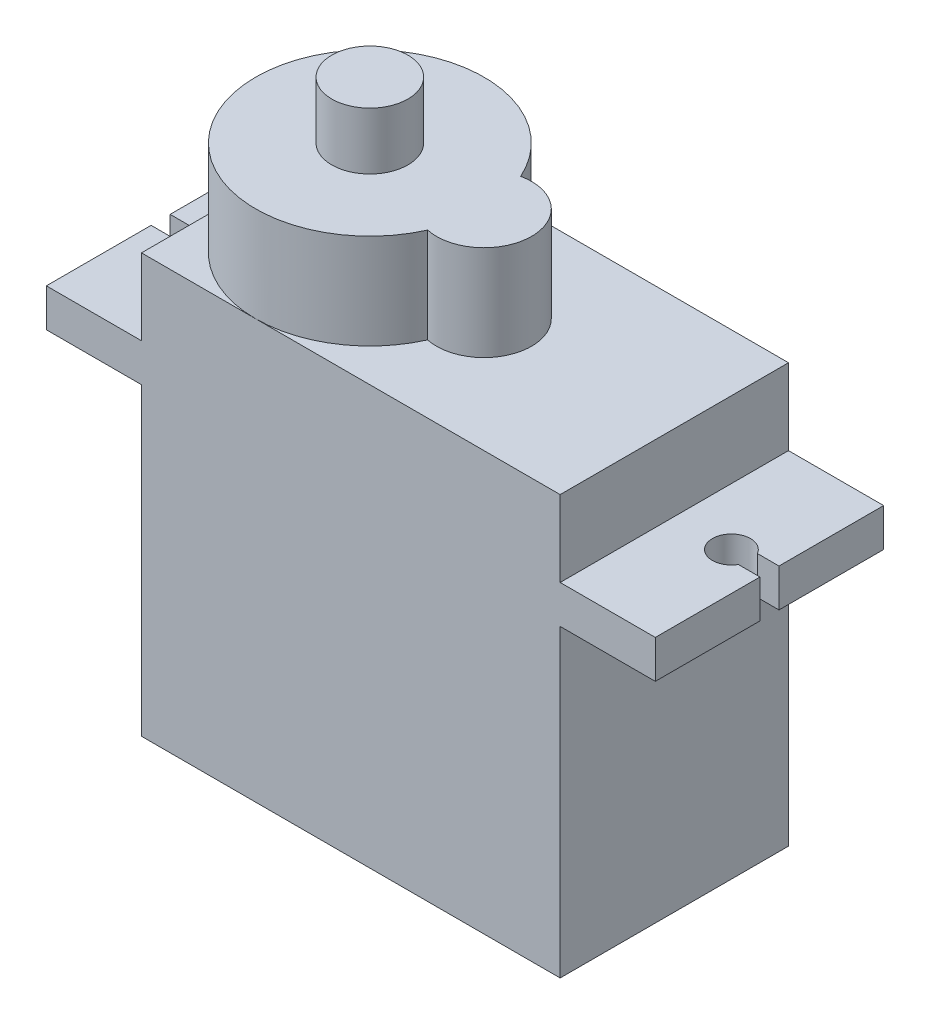
ISO-10303-21;
HEADER;
FILE_DESCRIPTION(('STEP AP214'),'2;1');
FILE_NAME('part.step','',(''),(''),'','','');
FILE_SCHEMA(('AUTOMOTIVE_DESIGN { 1 0 10303 214 1 1 1 1 }'));
ENDSEC;
DATA;
#1=APPLICATION_CONTEXT('core data for automotive mechanical design processes');
#2=APPLICATION_PROTOCOL_DEFINITION('international standard','automotive_design',2000,#1);
#3=PRODUCT_CONTEXT('',#1,'mechanical');
#4=PRODUCT('Part','Part','',(#3));
#5=PRODUCT_RELATED_PRODUCT_CATEGORY('part','',(#4));
#6=PRODUCT_DEFINITION_FORMATION('','',#4);
#7=PRODUCT_DEFINITION_CONTEXT('part definition',#1,'design');
#8=PRODUCT_DEFINITION('design','',#6,#7);
#9=PRODUCT_DEFINITION_SHAPE('','',#8);
#10=(LENGTH_UNIT() NAMED_UNIT(*) SI_UNIT(.MILLI.,.METRE.));
#11=(NAMED_UNIT(*) PLANE_ANGLE_UNIT() SI_UNIT($,.RADIAN.));
#12=(NAMED_UNIT(*) SI_UNIT($,.STERADIAN.) SOLID_ANGLE_UNIT());
#13=UNCERTAINTY_MEASURE_WITH_UNIT(LENGTH_MEASURE(1.E-05),#10,'distance_accuracy_value','');
#14=(GEOMETRIC_REPRESENTATION_CONTEXT(3) GLOBAL_UNCERTAINTY_ASSIGNED_CONTEXT((#13)) GLOBAL_UNIT_ASSIGNED_CONTEXT((#10,
#11,#12)) REPRESENTATION_CONTEXT('',''));
#15=CARTESIAN_POINT('',(0.,0.,0.));
#16=DIRECTION('',(0.,0.,1.));
#17=DIRECTION('',(1.,0.,0.));
#18=AXIS2_PLACEMENT_3D('',#15,#16,#17);
#19=CARTESIAN_POINT('',(-16.,18.,-11.3851648071345));
#20=DIRECTION('',(-1.,0.,0.));
#21=DIRECTION('',(0.,0.,1.));
#22=AXIS2_PLACEMENT_3D('',#19,#20,#21);
#23=PLANE('',#22);
#24=DIRECTION('',(0.,1.,0.));
#25=VECTOR('',#24,1.);
#26=CARTESIAN_POINT('',(-16.,15.,-0.504353806473952));
#27=LINE('',#26,#25);
#28=CARTESIAN_POINT('',(-16.,16.,-0.504353806473952));
#29=VERTEX_POINT('',#28);
#30=CARTESIAN_POINT('',(-16.,18.,-0.504353806473952));
#31=VERTEX_POINT('',#30);
#32=EDGE_CURVE('E402',#29,#31,#27,.T.);
#33=ORIENTED_EDGE('',*,*,#32,.T.);
#34=DIRECTION('',(0.,0.,1.));
#35=VECTOR('',#34,1.);
#36=CARTESIAN_POINT('',(-16.,18.,-11.3851648071345));
#37=LINE('',#36,#35);
#38=CARTESIAN_POINT('',(-16.,18.,-6.));
#39=VERTEX_POINT('',#38);
#40=EDGE_CURVE('E238',#39,#31,#37,.T.);
#41=ORIENTED_EDGE('',*,*,#40,.F.);
#42=DIRECTION('',(0.,1.,0.));
#43=VECTOR('',#42,1.);
#44=CARTESIAN_POINT('',(-16.,18.,-6.));
#45=LINE('',#44,#43);
#46=CARTESIAN_POINT('',(-16.,16.,-6.));
#47=VERTEX_POINT('',#46);
#48=EDGE_CURVE('E259',#47,#39,#45,.T.);
#49=ORIENTED_EDGE('',*,*,#48,.F.);
#50=DIRECTION('',(0.,0.,1.));
#51=VECTOR('',#50,1.);
#52=CARTESIAN_POINT('',(-16.,16.,-11.3851648071345));
#53=LINE('',#52,#51);
#54=EDGE_CURVE('E252',#47,#29,#53,.T.);
#55=ORIENTED_EDGE('',*,*,#54,.T.);
#56=EDGE_LOOP('',(#33,#41,#49,#55));
#57=FACE_BOUND('',#56,.T.);
#58=ADVANCED_FACE('F34',(#57),#23,.T.);
#59=CARTESIAN_POINT('',(16.,18.,-11.3851648071345));
#60=DIRECTION('',(1.,0.,0.));
#61=DIRECTION('',(0.,0.,-1.));
#62=AXIS2_PLACEMENT_3D('',#59,#60,#61);
#63=PLANE('',#62);
#64=DIRECTION('',(0.,1.,0.));
#65=VECTOR('',#64,1.);
#66=CARTESIAN_POINT('',(16.,15.,-0.5));
#67=LINE('',#66,#65);
#68=CARTESIAN_POINT('',(16.,16.,-0.5));
#69=VERTEX_POINT('',#68);
#70=CARTESIAN_POINT('',(16.,18.,-0.5));
#71=VERTEX_POINT('',#70);
#72=EDGE_CURVE('E414',#69,#71,#67,.T.);
#73=ORIENTED_EDGE('',*,*,#72,.F.);
#74=DIRECTION('',(0.,0.,1.));
#75=VECTOR('',#74,1.);
#76=CARTESIAN_POINT('',(16.,16.,-11.3851648071345));
#77=LINE('',#76,#75);
#78=CARTESIAN_POINT('',(16.,16.,-6.));
#79=VERTEX_POINT('',#78);
#80=EDGE_CURVE('E355',#79,#69,#77,.T.);
#81=ORIENTED_EDGE('',*,*,#80,.F.);
#82=DIRECTION('',(0.,-1.,0.));
#83=VECTOR('',#82,1.);
#84=CARTESIAN_POINT('',(16.,18.,-6.));
#85=LINE('',#84,#83);
#86=CARTESIAN_POINT('',(16.,18.,-6.));
#87=VERTEX_POINT('',#86);
#88=EDGE_CURVE('E365',#87,#79,#85,.T.);
#89=ORIENTED_EDGE('',*,*,#88,.F.);
#90=DIRECTION('',(0.,0.,1.));
#91=VECTOR('',#90,1.);
#92=CARTESIAN_POINT('',(16.,18.,-11.3851648071345));
#93=LINE('',#92,#91);
#94=EDGE_CURVE('E359',#87,#71,#93,.T.);
#95=ORIENTED_EDGE('',*,*,#94,.T.);
#96=EDGE_LOOP('',(#73,#81,#89,#95));
#97=FACE_BOUND('',#96,.T.);
#98=ADVANCED_FACE('F510',(#97),#63,.T.);
#99=CARTESIAN_POINT('',(-11.,22.,6.));
#100=DIRECTION('',(1.,0.,0.));
#101=DIRECTION('',(0.,0.,-1.));
#102=AXIS2_PLACEMENT_3D('',#99,#100,#101);
#103=PLANE('',#102);
#104=DIRECTION('',(0.,-1.,0.));
#105=VECTOR('',#104,1.);
#106=CARTESIAN_POINT('',(-11.,22.,6.));
#107=LINE('',#106,#105);
#108=CARTESIAN_POINT('',(-11.,16.,6.));
#109=VERTEX_POINT('',#108);
#110=CARTESIAN_POINT('',(-11.,0.,6.));
#111=VERTEX_POINT('',#110);
#112=EDGE_CURVE('E314',#109,#111,#107,.T.);
#113=ORIENTED_EDGE('',*,*,#112,.F.);
#114=DIRECTION('',(0.,0.,1.));
#115=VECTOR('',#114,1.);
#116=CARTESIAN_POINT('',(-11.,16.,-11.3851648071345));
#117=LINE('',#116,#115);
#118=CARTESIAN_POINT('',(-11.,16.,-6.));
#119=VERTEX_POINT('',#118);
#120=EDGE_CURVE('E244',#119,#109,#117,.T.);
#121=ORIENTED_EDGE('',*,*,#120,.F.);
#122=DIRECTION('',(0.,-1.,0.));
#123=VECTOR('',#122,1.);
#124=CARTESIAN_POINT('',(-11.,22.,-6.));
#125=LINE('',#124,#123);
#126=CARTESIAN_POINT('',(-11.,0.,-6.));
#127=VERTEX_POINT('',#126);
#128=EDGE_CURVE('E318',#119,#127,#125,.T.);
#129=ORIENTED_EDGE('',*,*,#128,.T.);
#130=DIRECTION('',(0.,0.,1.));
#131=VECTOR('',#130,1.);
#132=CARTESIAN_POINT('',(-11.,0.,6.));
#133=LINE('',#132,#131);
#134=EDGE_CURVE('E307',#127,#111,#133,.T.);
#135=ORIENTED_EDGE('',*,*,#134,.T.);
#136=EDGE_LOOP('',(#113,#121,#129,#135));
#137=FACE_BOUND('',#136,.T.);
#138=DIRECTION('',(0.,-1.,0.));
#139=VECTOR('',#138,1.);
#140=CARTESIAN_POINT('',(-11.,6.5,-1.5));
#141=LINE('',#140,#139);
#142=CARTESIAN_POINT('',(-11.,6.5,-1.5));
#143=VERTEX_POINT('',#142);
#144=CARTESIAN_POINT('',(-11.,5.,-1.5));
#145=VERTEX_POINT('',#144);
#146=EDGE_CURVE('E399',#143,#145,#141,.T.);
#147=ORIENTED_EDGE('',*,*,#146,.F.);
#148=DIRECTION('',(0.,0.,-1.));
#149=VECTOR('',#148,1.);
#150=CARTESIAN_POINT('',(-11.,6.5,-1.5));
#151=LINE('',#150,#149);
#152=CARTESIAN_POINT('',(-11.,6.5,1.5));
#153=VERTEX_POINT('',#152);
#154=EDGE_CURVE('E389',#153,#143,#151,.T.);
#155=ORIENTED_EDGE('',*,*,#154,.F.);
#156=DIRECTION('',(0.,1.,0.));
#157=VECTOR('',#156,1.);
#158=CARTESIAN_POINT('',(-11.,6.5,1.5));
#159=LINE('',#158,#157);
#160=CARTESIAN_POINT('',(-11.,5.,1.5));
#161=VERTEX_POINT('',#160);
#162=EDGE_CURVE('E393',#161,#153,#159,.T.);
#163=ORIENTED_EDGE('',*,*,#162,.F.);
#164=DIRECTION('',(0.,0.,1.));
#165=VECTOR('',#164,1.);
#166=CARTESIAN_POINT('',(-11.,5.,-1.5));
#167=LINE('',#166,#165);
#168=EDGE_CURVE('E396',#145,#161,#167,.T.);
#169=ORIENTED_EDGE('',*,*,#168,.F.);
#170=EDGE_LOOP('',(#147,#155,#163,#169));
#171=FACE_BOUND('',#170,.T.);
#172=ADVANCED_FACE('F441',(#137,#171),#103,.F.);
#173=CARTESIAN_POINT('',(11.,22.,6.));
#174=DIRECTION('',(-1.,0.,0.));
#175=DIRECTION('',(0.,0.,1.));
#176=AXIS2_PLACEMENT_3D('',#173,#174,#175);
#177=PLANE('',#176);
#178=DIRECTION('',(0.,0.,1.));
#179=VECTOR('',#178,1.);
#180=CARTESIAN_POINT('',(11.,18.,-11.3851648071345));
#181=LINE('',#180,#179);
#182=CARTESIAN_POINT('',(11.,18.,-6.));
#183=VERTEX_POINT('',#182);
#184=CARTESIAN_POINT('',(11.,18.,6.));
#185=VERTEX_POINT('',#184);
#186=EDGE_CURVE('E362',#183,#185,#181,.T.);
#187=ORIENTED_EDGE('',*,*,#186,.F.);
#188=DIRECTION('',(0.,-1.,0.));
#189=VECTOR('',#188,1.);
#190=CARTESIAN_POINT('',(11.,22.,-6.));
#191=LINE('',#190,#189);
#192=CARTESIAN_POINT('',(11.,22.,-6.));
#193=VERTEX_POINT('',#192);
#194=EDGE_CURVE('E323',#193,#183,#191,.T.);
#195=ORIENTED_EDGE('',*,*,#194,.F.);
#196=DIRECTION('',(0.,0.,-1.));
#197=VECTOR('',#196,1.);
#198=CARTESIAN_POINT('',(11.,22.,6.));
#199=LINE('',#198,#197);
#200=CARTESIAN_POINT('',(11.,22.,6.));
#201=VERTEX_POINT('',#200);
#202=EDGE_CURVE('E285',#201,#193,#199,.T.);
#203=ORIENTED_EDGE('',*,*,#202,.F.);
#204=DIRECTION('',(0.,-1.,0.));
#205=VECTOR('',#204,1.);
#206=CARTESIAN_POINT('',(11.,22.,6.));
#207=LINE('',#206,#205);
#208=EDGE_CURVE('E312',#201,#185,#207,.T.);
#209=ORIENTED_EDGE('',*,*,#208,.T.);
#210=EDGE_LOOP('',(#187,#195,#203,#209));
#211=FACE_BOUND('',#210,.T.);
#212=ADVANCED_FACE('F475',(#211),#177,.F.);
#213=CARTESIAN_POINT('',(-11.,22.,-6.));
#214=VERTEX_POINT('',#213);
#215=CARTESIAN_POINT('',(-11.,18.,-6.));
#216=VERTEX_POINT('',#215);
#217=EDGE_CURVE('E319',#214,#216,#125,.T.);
#218=ORIENTED_EDGE('',*,*,#217,.T.);
#219=DIRECTION('',(0.,0.,1.));
#220=VECTOR('',#219,1.);
#221=CARTESIAN_POINT('',(-11.,18.,-11.3851648071345));
#222=LINE('',#221,#220);
#223=CARTESIAN_POINT('',(-11.,18.,6.));
#224=VERTEX_POINT('',#223);
#225=EDGE_CURVE('E239',#216,#224,#222,.T.);
#226=ORIENTED_EDGE('',*,*,#225,.T.);
#227=CARTESIAN_POINT('',(-11.,22.,6.));
#228=VERTEX_POINT('',#227);
#229=EDGE_CURVE('E315',#228,#224,#107,.T.);
#230=ORIENTED_EDGE('',*,*,#229,.F.);
#231=DIRECTION('',(0.,0.,1.));
#232=VECTOR('',#231,1.);
#233=CARTESIAN_POINT('',(-11.,22.,6.));
#234=LINE('',#233,#232);
#235=CARTESIAN_POINT('',(-11.,22.,0.));
#236=VERTEX_POINT('',#235);
#237=EDGE_CURVE('E293',#236,#228,#234,.T.);
#238=ORIENTED_EDGE('',*,*,#237,.F.);
#239=EDGE_CURVE('E294',#214,#236,#234,.T.);
#240=ORIENTED_EDGE('',*,*,#239,.F.);
#241=EDGE_LOOP('',(#218,#226,#230,#238,#240));
#242=FACE_BOUND('',#241,.T.);
#243=ADVANCED_FACE('F499',(#242),#103,.F.);
#244=CARTESIAN_POINT('',(0.,22.,0.));
#245=DIRECTION('',(0.,-1.,0.));
#246=DIRECTION('',(0.,0.,-1.));
#247=AXIS2_PLACEMENT_3D('',#244,#245,#246);
#248=PLANE('',#247);
#249=CARTESIAN_POINT('',(1.,22.,0.));
#250=DIRECTION('',(0.,1.,0.));
#251=DIRECTION('',(0.,0.,1.));
#252=AXIS2_PLACEMENT_3D('',#249,#250,#251);
#253=CIRCLE('',#252,2.5);
#254=CARTESIAN_POINT('',(0.479166666666665,22.,2.44514470714698));
#255=VERTEX_POINT('',#254);
#256=CARTESIAN_POINT('',(0.479166666666665,22.,-2.44514470714698));
#257=VERTEX_POINT('',#256);
#258=EDGE_CURVE('E263',#255,#257,#253,.T.);
#259=ORIENTED_EDGE('',*,*,#258,.F.);
#260=CARTESIAN_POINT('',(-5.,22.,0.));
#261=DIRECTION('',(0.,1.,0.));
#262=DIRECTION('',(0.,0.,1.));
#263=AXIS2_PLACEMENT_3D('',#260,#261,#262);
#264=CIRCLE('',#263,6.);
#265=CARTESIAN_POINT('',(-5.,22.,6.));
#266=VERTEX_POINT('',#265);
#267=EDGE_CURVE('E278',#266,#255,#264,.T.);
#268=ORIENTED_EDGE('',*,*,#267,.F.);
#269=DIRECTION('',(1.,0.,0.));
#270=VECTOR('',#269,1.);
#271=CARTESIAN_POINT('',(-11.,22.,6.));
#272=LINE('',#271,#270);
#273=EDGE_CURVE('E297',#266,#201,#272,.T.);
#274=ORIENTED_EDGE('',*,*,#273,.T.);
#275=ORIENTED_EDGE('',*,*,#202,.T.);
#276=DIRECTION('',(-1.,0.,0.));
#277=VECTOR('',#276,1.);
#278=CARTESIAN_POINT('',(-11.,22.,-6.));
#279=LINE('',#278,#277);
#280=CARTESIAN_POINT('',(-5.,22.,-6.));
#281=VERTEX_POINT('',#280);
#282=EDGE_CURVE('E290',#193,#281,#279,.T.);
#283=ORIENTED_EDGE('',*,*,#282,.T.);
#284=EDGE_CURVE('E270',#257,#281,#264,.T.);
#285=ORIENTED_EDGE('',*,*,#284,.F.);
#286=EDGE_LOOP('',(#259,#268,#274,#275,#283,#285));
#287=FACE_BOUND('',#286,.T.);
#288=ADVANCED_FACE('F481',(#287),#248,.F.);
#289=EDGE_CURVE('E277',#281,#236,#264,.T.);
#290=ORIENTED_EDGE('',*,*,#289,.F.);
#291=EDGE_CURVE('E288',#281,#214,#279,.T.);
#292=ORIENTED_EDGE('',*,*,#291,.T.);
#293=ORIENTED_EDGE('',*,*,#239,.T.);
#294=EDGE_LOOP('',(#290,#292,#293));
#295=FACE_BOUND('',#294,.T.);
#296=ADVANCED_FACE('F496',(#295),#248,.F.);
#297=CARTESIAN_POINT('',(11.,16.,-6.));
#298=VERTEX_POINT('',#297);
#299=CARTESIAN_POINT('',(11.,0.,-6.));
#300=VERTEX_POINT('',#299);
#301=EDGE_CURVE('E322',#298,#300,#191,.T.);
#302=ORIENTED_EDGE('',*,*,#301,.F.);
#303=DIRECTION('',(0.,0.,1.));
#304=VECTOR('',#303,1.);
#305=CARTESIAN_POINT('',(11.,16.,-11.3851648071345));
#306=LINE('',#305,#304);
#307=CARTESIAN_POINT('',(11.,16.,6.));
#308=VERTEX_POINT('',#307);
#309=EDGE_CURVE('E351',#298,#308,#306,.T.);
#310=ORIENTED_EDGE('',*,*,#309,.T.);
#311=CARTESIAN_POINT('',(11.,0.,6.));
#312=VERTEX_POINT('',#311);
#313=EDGE_CURVE('E301',#308,#312,#207,.T.);
#314=ORIENTED_EDGE('',*,*,#313,.T.);
#315=DIRECTION('',(0.,0.,-1.));
#316=VECTOR('',#315,1.);
#317=CARTESIAN_POINT('',(11.,0.,6.));
#318=LINE('',#317,#316);
#319=EDGE_CURVE('E284',#312,#300,#318,.T.);
#320=ORIENTED_EDGE('',*,*,#319,.T.);
#321=EDGE_LOOP('',(#302,#310,#314,#320));
#322=FACE_BOUND('',#321,.T.);
#323=ADVANCED_FACE('F36',(#322),#177,.F.);
#324=CARTESIAN_POINT('',(-11.,22.,-6.));
#325=DIRECTION('',(0.,0.,1.));
#326=DIRECTION('',(1.,0.,0.));
#327=AXIS2_PLACEMENT_3D('',#324,#325,#326);
#328=PLANE('',#327);
#329=DIRECTION('',(-1.,0.,0.));
#330=VECTOR('',#329,1.);
#331=CARTESIAN_POINT('',(-11.,0.,-6.));
#332=LINE('',#331,#330);
#333=EDGE_CURVE('E304',#300,#127,#332,.T.);
#334=ORIENTED_EDGE('',*,*,#333,.T.);
#335=ORIENTED_EDGE('',*,*,#128,.F.);
#336=DIRECTION('',(-1.,0.,0.));
#337=VECTOR('',#336,1.);
#338=CARTESIAN_POINT('',(-16.,16.,-6.));
#339=LINE('',#338,#337);
#340=EDGE_CURVE('E256',#119,#47,#339,.T.);
#341=ORIENTED_EDGE('',*,*,#340,.T.);
#342=ORIENTED_EDGE('',*,*,#48,.T.);
#343=DIRECTION('',(1.,0.,0.));
#344=VECTOR('',#343,1.);
#345=CARTESIAN_POINT('',(-16.,18.,-6.));
#346=LINE('',#345,#344);
#347=EDGE_CURVE('E242',#39,#216,#346,.T.);
#348=ORIENTED_EDGE('',*,*,#347,.T.);
#349=ORIENTED_EDGE('',*,*,#217,.F.);
#350=ORIENTED_EDGE('',*,*,#291,.F.);
#351=ORIENTED_EDGE('',*,*,#282,.F.);
#352=ORIENTED_EDGE('',*,*,#194,.T.);
#353=DIRECTION('',(1.,0.,0.));
#354=VECTOR('',#353,1.);
#355=CARTESIAN_POINT('',(11.,18.,-6.));
#356=LINE('',#355,#354);
#357=EDGE_CURVE('E350',#183,#87,#356,.T.);
#358=ORIENTED_EDGE('',*,*,#357,.T.);
#359=ORIENTED_EDGE('',*,*,#88,.T.);
#360=DIRECTION('',(-1.,0.,0.));
#361=VECTOR('',#360,1.);
#362=CARTESIAN_POINT('',(11.,16.,-6.));
#363=LINE('',#362,#361);
#364=EDGE_CURVE('E343',#79,#298,#363,.T.);
#365=ORIENTED_EDGE('',*,*,#364,.T.);
#366=ORIENTED_EDGE('',*,*,#301,.T.);
#367=EDGE_LOOP('',(#334,#335,#341,#342,#348,#349,#350,#351,#352,#358,#359,#365,#366));
#368=FACE_BOUND('',#367,.T.);
#369=ADVANCED_FACE('F443',(#368),#328,.F.);
#370=CARTESIAN_POINT('',(-11.,22.,6.));
#371=DIRECTION('',(0.,0.,-1.));
#372=DIRECTION('',(-1.,0.,0.));
#373=AXIS2_PLACEMENT_3D('',#370,#371,#372);
#374=PLANE('',#373);
#375=DIRECTION('',(1.,0.,0.));
#376=VECTOR('',#375,1.);
#377=CARTESIAN_POINT('',(-11.,0.,6.));
#378=LINE('',#377,#376);
#379=EDGE_CURVE('E289',#111,#312,#378,.T.);
#380=ORIENTED_EDGE('',*,*,#379,.T.);
#381=ORIENTED_EDGE('',*,*,#313,.F.);
#382=DIRECTION('',(1.,0.,0.));
#383=VECTOR('',#382,1.);
#384=CARTESIAN_POINT('',(11.,16.,6.));
#385=LINE('',#384,#383);
#386=CARTESIAN_POINT('',(16.,16.,6.));
#387=VERTEX_POINT('',#386);
#388=EDGE_CURVE('E371',#308,#387,#385,.T.);
#389=ORIENTED_EDGE('',*,*,#388,.T.);
#390=DIRECTION('',(0.,1.,0.));
#391=VECTOR('',#390,1.);
#392=CARTESIAN_POINT('',(16.,18.,6.));
#393=LINE('',#392,#391);
#394=CARTESIAN_POINT('',(16.,18.,6.));
#395=VERTEX_POINT('',#394);
#396=EDGE_CURVE('E368',#387,#395,#393,.T.);
#397=ORIENTED_EDGE('',*,*,#396,.T.);
#398=DIRECTION('',(-1.,0.,0.));
#399=VECTOR('',#398,1.);
#400=CARTESIAN_POINT('',(11.,18.,6.));
#401=LINE('',#400,#399);
#402=EDGE_CURVE('E354',#395,#185,#401,.T.);
#403=ORIENTED_EDGE('',*,*,#402,.T.);
#404=ORIENTED_EDGE('',*,*,#208,.F.);
#405=ORIENTED_EDGE('',*,*,#273,.F.);
#406=EDGE_CURVE('E298',#228,#266,#272,.T.);
#407=ORIENTED_EDGE('',*,*,#406,.F.);
#408=ORIENTED_EDGE('',*,*,#229,.T.);
#409=DIRECTION('',(-1.,0.,0.));
#410=VECTOR('',#409,1.);
#411=CARTESIAN_POINT('',(-16.,18.,6.));
#412=LINE('',#411,#410);
#413=CARTESIAN_POINT('',(-16.,18.,6.));
#414=VERTEX_POINT('',#413);
#415=EDGE_CURVE('E247',#224,#414,#412,.T.);
#416=ORIENTED_EDGE('',*,*,#415,.T.);
#417=DIRECTION('',(0.,-1.,0.));
#418=VECTOR('',#417,1.);
#419=CARTESIAN_POINT('',(-16.,18.,6.));
#420=LINE('',#419,#418);
#421=CARTESIAN_POINT('',(-16.,16.,6.));
#422=VERTEX_POINT('',#421);
#423=EDGE_CURVE('E236',#414,#422,#420,.T.);
#424=ORIENTED_EDGE('',*,*,#423,.T.);
#425=DIRECTION('',(1.,0.,0.));
#426=VECTOR('',#425,1.);
#427=CARTESIAN_POINT('',(-16.,16.,6.));
#428=LINE('',#427,#426);
#429=EDGE_CURVE('E341',#422,#109,#428,.T.);
#430=ORIENTED_EDGE('',*,*,#429,.T.);
#431=ORIENTED_EDGE('',*,*,#112,.T.);
#432=EDGE_LOOP('',(#380,#381,#389,#397,#403,#404,#405,#407,#408,#416,#424,#430,#431));
#433=FACE_BOUND('',#432,.T.);
#434=ADVANCED_FACE('F451',(#433),#374,.F.);
#435=EDGE_CURVE('E488',#236,#266,#264,.T.);
#436=ORIENTED_EDGE('',*,*,#435,.F.);
#437=ORIENTED_EDGE('',*,*,#237,.T.);
#438=ORIENTED_EDGE('',*,*,#406,.T.);
#439=EDGE_LOOP('',(#436,#437,#438));
#440=FACE_BOUND('',#439,.T.);
#441=ADVANCED_FACE('F487',(#440),#248,.F.);
#442=CARTESIAN_POINT('',(0.,0.,0.));
#443=DIRECTION('',(0.,-1.,0.));
#444=DIRECTION('',(0.,0.,-1.));
#445=AXIS2_PLACEMENT_3D('',#442,#443,#444);
#446=PLANE('',#445);
#447=ORIENTED_EDGE('',*,*,#319,.F.);
#448=ORIENTED_EDGE('',*,*,#379,.F.);
#449=ORIENTED_EDGE('',*,*,#134,.F.);
#450=ORIENTED_EDGE('',*,*,#333,.F.);
#451=EDGE_LOOP('',(#447,#448,#449,#450));
#452=FACE_BOUND('',#451,.T.);
#453=ADVANCED_FACE('F449',(#452),#446,.T.);
#454=CARTESIAN_POINT('',(1.,27.,0.));
#455=DIRECTION('',(0.,-1.,0.));
#456=DIRECTION('',(0.,0.,-1.));
#457=AXIS2_PLACEMENT_3D('',#454,#455,#456);
#458=CYLINDRICAL_SURFACE('',#457,2.5);
#459=ORIENTED_EDGE('',*,*,#258,.T.);
#460=DIRECTION('',(0.,-1.,0.));
#461=VECTOR('',#460,1.);
#462=CARTESIAN_POINT('',(0.479166666666665,27.,-2.44514470714698));
#463=LINE('',#462,#461);
#464=CARTESIAN_POINT('',(0.479166666666665,27.,-2.44514470714698));
#465=VERTEX_POINT('',#464);
#466=EDGE_CURVE('E281',#465,#257,#463,.T.);
#467=ORIENTED_EDGE('',*,*,#466,.F.);
#468=CARTESIAN_POINT('',(1.,27.,0.));
#469=DIRECTION('',(0.,1.,0.));
#470=DIRECTION('',(0.,0.,1.));
#471=AXIS2_PLACEMENT_3D('',#468,#469,#470);
#472=CIRCLE('',#471,2.5);
#473=CARTESIAN_POINT('',(0.479166666666665,27.,2.44514470714698));
#474=VERTEX_POINT('',#473);
#475=EDGE_CURVE('E266',#474,#465,#472,.T.);
#476=ORIENTED_EDGE('',*,*,#475,.F.);
#477=DIRECTION('',(0.,-1.,0.));
#478=VECTOR('',#477,1.);
#479=CARTESIAN_POINT('',(0.479166666666665,27.,2.44514470714698));
#480=LINE('',#479,#478);
#481=EDGE_CURVE('E272',#474,#255,#480,.T.);
#482=ORIENTED_EDGE('',*,*,#481,.T.);
#483=EDGE_LOOP('',(#459,#467,#476,#482));
#484=FACE_BOUND('',#483,.T.);
#485=ADVANCED_FACE('F541',(#484),#458,.T.);
#486=CARTESIAN_POINT('',(-5.,27.,0.));
#487=DIRECTION('',(0.,-1.,0.));
#488=DIRECTION('',(0.,0.,-1.));
#489=AXIS2_PLACEMENT_3D('',#486,#487,#488);
#490=CYLINDRICAL_SURFACE('',#489,6.);
#491=ORIENTED_EDGE('',*,*,#284,.T.);
#492=ORIENTED_EDGE('',*,*,#289,.T.);
#493=ORIENTED_EDGE('',*,*,#435,.T.);
#494=ORIENTED_EDGE('',*,*,#267,.T.);
#495=ORIENTED_EDGE('',*,*,#481,.F.);
#496=CARTESIAN_POINT('',(-5.,27.,0.));
#497=DIRECTION('',(0.,1.,0.));
#498=DIRECTION('',(0.,0.,1.));
#499=AXIS2_PLACEMENT_3D('',#496,#497,#498);
#500=CIRCLE('',#499,6.);
#501=EDGE_CURVE('E269',#465,#474,#500,.T.);
#502=ORIENTED_EDGE('',*,*,#501,.F.);
#503=ORIENTED_EDGE('',*,*,#466,.T.);
#504=EDGE_LOOP('',(#491,#492,#493,#494,#495,#502,#503));
#505=FACE_BOUND('',#504,.T.);
#506=ADVANCED_FACE('F493',(#505),#490,.T.);
#507=CARTESIAN_POINT('',(-2.,27.,0.));
#508=DIRECTION('',(0.,1.,0.));
#509=DIRECTION('',(0.,0.,1.));
#510=AXIS2_PLACEMENT_3D('',#507,#508,#509);
#511=PLANE('',#510);
#512=CARTESIAN_POINT('',(-5.,27.,0.));
#513=DIRECTION('',(0.,1.,0.));
#514=DIRECTION('',(0.,0.,1.));
#515=AXIS2_PLACEMENT_3D('',#512,#513,#514);
#516=CIRCLE('',#515,2.);
#517=CARTESIAN_POINT('',(-5.,27.,2.));
#518=VERTEX_POINT('',#517);
#519=EDGE_CURVE('E258',#518,#518,#516,.T.);
#520=ORIENTED_EDGE('',*,*,#519,.F.);
#521=EDGE_LOOP('',(#520));
#522=FACE_BOUND('',#521,.T.);
#523=ORIENTED_EDGE('',*,*,#475,.T.);
#524=ORIENTED_EDGE('',*,*,#501,.T.);
#525=EDGE_LOOP('',(#523,#524));
#526=FACE_BOUND('',#525,.T.);
#527=ADVANCED_FACE('F532',(#522,#526),#511,.T.);
#528=CARTESIAN_POINT('',(-5.,30.,0.));
#529=DIRECTION('',(0.,-1.,0.));
#530=DIRECTION('',(0.,0.,-1.));
#531=AXIS2_PLACEMENT_3D('',#528,#529,#530);
#532=CYLINDRICAL_SURFACE('',#531,2.);
#533=CARTESIAN_POINT('',(-5.,30.,0.));
#534=DIRECTION('',(0.,1.,0.));
#535=DIRECTION('',(0.,0.,1.));
#536=AXIS2_PLACEMENT_3D('',#533,#534,#535);
#537=CIRCLE('',#536,2.);
#538=CARTESIAN_POINT('',(-5.,30.,2.));
#539=VERTEX_POINT('',#538);
#540=EDGE_CURVE('E260',#539,#539,#537,.T.);
#541=ORIENTED_EDGE('',*,*,#540,.F.);
#542=EDGE_LOOP('',(#541));
#543=FACE_BOUND('',#542,.T.);
#544=ORIENTED_EDGE('',*,*,#519,.T.);
#545=EDGE_LOOP('',(#544));
#546=FACE_BOUND('',#545,.T.);
#547=ADVANCED_FACE('F527',(#543,#546),#532,.T.);
#548=CARTESIAN_POINT('',(-5.,30.,0.));
#549=DIRECTION('',(0.,1.,0.));
#550=DIRECTION('',(0.,0.,1.));
#551=AXIS2_PLACEMENT_3D('',#548,#549,#550);
#552=PLANE('',#551);
#553=ORIENTED_EDGE('',*,*,#540,.T.);
#554=EDGE_LOOP('',(#553));
#555=FACE_BOUND('',#554,.T.);
#556=ADVANCED_FACE('F521',(#555),#552,.T.);
#557=DIRECTION('',(0.,1.,0.));
#558=VECTOR('',#557,1.);
#559=CARTESIAN_POINT('',(-16.,15.,0.495646193526049));
#560=LINE('',#559,#558);
#561=CARTESIAN_POINT('',(-16.,16.,0.495646193526049));
#562=VERTEX_POINT('',#561);
#563=CARTESIAN_POINT('',(-16.,18.,0.495646193526049));
#564=VERTEX_POINT('',#563);
#565=EDGE_CURVE('E213',#562,#564,#560,.T.);
#566=ORIENTED_EDGE('',*,*,#565,.F.);
#567=EDGE_CURVE('E255',#562,#422,#53,.T.);
#568=ORIENTED_EDGE('',*,*,#567,.T.);
#569=ORIENTED_EDGE('',*,*,#423,.F.);
#570=EDGE_CURVE('E228',#564,#414,#37,.T.);
#571=ORIENTED_EDGE('',*,*,#570,.F.);
#572=EDGE_LOOP('',(#566,#568,#569,#571));
#573=FACE_BOUND('',#572,.T.);
#574=ADVANCED_FACE('F234',(#573),#23,.T.);
#575=CARTESIAN_POINT('',(-16.,18.,-11.3851648071345));
#576=DIRECTION('',(0.,1.,0.));
#577=DIRECTION('',(0.,0.,1.));
#578=AXIS2_PLACEMENT_3D('',#575,#576,#577);
#579=PLANE('',#578);
#580=DIRECTION('',(-1.,0.,0.));
#581=VECTOR('',#580,1.);
#582=CARTESIAN_POINT('',(-16.,18.,-0.504353806473952));
#583=LINE('',#582,#581);
#584=CARTESIAN_POINT('',(-14.863497097792,18.,-0.504353806473953));
#585=VERTEX_POINT('',#584);
#586=EDGE_CURVE('E223',#585,#31,#583,.T.);
#587=ORIENTED_EDGE('',*,*,#586,.F.);
#588=CARTESIAN_POINT('',(-14.,18.,0.));
#589=DIRECTION('',(0.,1.,0.));
#590=DIRECTION('',(0.,0.,1.));
#591=AXIS2_PLACEMENT_3D('',#588,#589,#590);
#592=CIRCLE('',#591,1.);
#593=CARTESIAN_POINT('',(-14.8685245251823,18.,0.495646193526049));
#594=VERTEX_POINT('',#593);
#595=EDGE_CURVE('E231',#594,#585,#592,.T.);
#596=ORIENTED_EDGE('',*,*,#595,.F.);
#597=DIRECTION('',(1.,0.,0.));
#598=VECTOR('',#597,1.);
#599=CARTESIAN_POINT('',(-16.,18.,0.495646193526049));
#600=LINE('',#599,#598);
#601=EDGE_CURVE('E216',#564,#594,#600,.T.);
#602=ORIENTED_EDGE('',*,*,#601,.F.);
#603=ORIENTED_EDGE('',*,*,#570,.T.);
#604=ORIENTED_EDGE('',*,*,#415,.F.);
#605=ORIENTED_EDGE('',*,*,#225,.F.);
#606=ORIENTED_EDGE('',*,*,#347,.F.);
#607=ORIENTED_EDGE('',*,*,#40,.T.);
#608=EDGE_LOOP('',(#587,#596,#602,#603,#604,#605,#606,#607));
#609=FACE_BOUND('',#608,.T.);
#610=ADVANCED_FACE('F227',(#609),#579,.T.);
#611=CARTESIAN_POINT('',(-16.,16.,-11.3851648071345));
#612=DIRECTION('',(0.,-1.,0.));
#613=DIRECTION('',(0.,0.,-1.));
#614=AXIS2_PLACEMENT_3D('',#611,#612,#613);
#615=PLANE('',#614);
#616=DIRECTION('',(1.,0.,0.));
#617=VECTOR('',#616,1.);
#618=CARTESIAN_POINT('',(-16.,16.,-0.504353806473953));
#619=LINE('',#618,#617);
#620=CARTESIAN_POINT('',(-14.863497097792,16.,-0.504353806473953));
#621=VERTEX_POINT('',#620);
#622=EDGE_CURVE('E11',#29,#621,#619,.T.);
#623=ORIENTED_EDGE('',*,*,#622,.F.);
#624=ORIENTED_EDGE('',*,*,#54,.F.);
#625=ORIENTED_EDGE('',*,*,#340,.F.);
#626=ORIENTED_EDGE('',*,*,#120,.T.);
#627=ORIENTED_EDGE('',*,*,#429,.F.);
#628=ORIENTED_EDGE('',*,*,#567,.F.);
#629=DIRECTION('',(-1.,0.,0.));
#630=VECTOR('',#629,1.);
#631=CARTESIAN_POINT('',(-16.,16.,0.495646193526048));
#632=LINE('',#631,#630);
#633=CARTESIAN_POINT('',(-14.8685245251823,16.,0.495646193526048));
#634=VERTEX_POINT('',#633);
#635=EDGE_CURVE('E219',#634,#562,#632,.T.);
#636=ORIENTED_EDGE('',*,*,#635,.F.);
#637=CARTESIAN_POINT('',(-14.,16.,0.));
#638=DIRECTION('',(0.,-1.,0.));
#639=DIRECTION('',(0.,0.,-1.));
#640=AXIS2_PLACEMENT_3D('',#637,#638,#639);
#641=CIRCLE('',#640,1.);
#642=EDGE_CURVE('E42',#621,#634,#641,.T.);
#643=ORIENTED_EDGE('',*,*,#642,.F.);
#644=EDGE_LOOP('',(#623,#624,#625,#626,#627,#628,#636,#643));
#645=FACE_BOUND('',#644,.T.);
#646=ADVANCED_FACE('F339',(#645),#615,.T.);
#647=CARTESIAN_POINT('',(11.,18.,-11.3851648071345));
#648=DIRECTION('',(0.,1.,0.));
#649=DIRECTION('',(0.,0.,1.));
#650=AXIS2_PLACEMENT_3D('',#647,#648,#649);
#651=PLANE('',#650);
#652=DIRECTION('',(-1.,0.,0.));
#653=VECTOR('',#652,1.);
#654=CARTESIAN_POINT('',(14.8660254037844,18.,-0.5));
#655=LINE('',#654,#653);
#656=CARTESIAN_POINT('',(14.8660254037844,18.,-0.5));
#657=VERTEX_POINT('',#656);
#658=EDGE_CURVE('E412',#71,#657,#655,.T.);
#659=ORIENTED_EDGE('',*,*,#658,.F.);
#660=ORIENTED_EDGE('',*,*,#94,.F.);
#661=ORIENTED_EDGE('',*,*,#357,.F.);
#662=ORIENTED_EDGE('',*,*,#186,.T.);
#663=ORIENTED_EDGE('',*,*,#402,.F.);
#664=CARTESIAN_POINT('',(16.,18.,0.5));
#665=VERTEX_POINT('',#664);
#666=EDGE_CURVE('E358',#665,#395,#93,.T.);
#667=ORIENTED_EDGE('',*,*,#666,.F.);
#668=DIRECTION('',(1.,0.,0.));
#669=VECTOR('',#668,1.);
#670=CARTESIAN_POINT('',(14.8660254037844,18.,0.5));
#671=LINE('',#670,#669);
#672=CARTESIAN_POINT('',(14.8660254037844,18.,0.5));
#673=VERTEX_POINT('',#672);
#674=EDGE_CURVE('E419',#673,#665,#671,.T.);
#675=ORIENTED_EDGE('',*,*,#674,.F.);
#676=CARTESIAN_POINT('',(14.,18.,0.));
#677=DIRECTION('',(0.,1.,0.));
#678=DIRECTION('',(0.,0.,1.));
#679=AXIS2_PLACEMENT_3D('',#676,#677,#678);
#680=CIRCLE('',#679,1.);
#681=EDGE_CURVE('E421',#657,#673,#680,.T.);
#682=ORIENTED_EDGE('',*,*,#681,.F.);
#683=EDGE_LOOP('',(#659,#660,#661,#662,#663,#667,#675,#682));
#684=FACE_BOUND('',#683,.T.);
#685=ADVANCED_FACE('F469',(#684),#651,.T.);
#686=DIRECTION('',(0.,1.,0.));
#687=VECTOR('',#686,1.);
#688=CARTESIAN_POINT('',(16.,15.,0.5));
#689=LINE('',#688,#687);
#690=CARTESIAN_POINT('',(16.,16.,0.5));
#691=VERTEX_POINT('',#690);
#692=EDGE_CURVE('E57',#691,#665,#689,.T.);
#693=ORIENTED_EDGE('',*,*,#692,.T.);
#694=ORIENTED_EDGE('',*,*,#666,.T.);
#695=ORIENTED_EDGE('',*,*,#396,.F.);
#696=EDGE_CURVE('E353',#691,#387,#77,.T.);
#697=ORIENTED_EDGE('',*,*,#696,.F.);
#698=EDGE_LOOP('',(#693,#694,#695,#697));
#699=FACE_BOUND('',#698,.T.);
#700=ADVANCED_FACE('F463',(#699),#63,.T.);
#701=CARTESIAN_POINT('',(11.,16.,-11.3851648071345));
#702=DIRECTION('',(0.,-1.,0.));
#703=DIRECTION('',(0.,0.,-1.));
#704=AXIS2_PLACEMENT_3D('',#701,#702,#703);
#705=PLANE('',#704);
#706=DIRECTION('',(1.,0.,0.));
#707=VECTOR('',#706,1.);
#708=CARTESIAN_POINT('',(11.,16.,-0.5));
#709=LINE('',#708,#707);
#710=CARTESIAN_POINT('',(14.8660254037844,16.,-0.5));
#711=VERTEX_POINT('',#710);
#712=EDGE_CURVE('E330',#711,#69,#709,.T.);
#713=ORIENTED_EDGE('',*,*,#712,.F.);
#714=CARTESIAN_POINT('',(14.,16.,0.));
#715=DIRECTION('',(0.,-1.,0.));
#716=DIRECTION('',(0.,0.,-1.));
#717=AXIS2_PLACEMENT_3D('',#714,#715,#716);
#718=CIRCLE('',#717,1.);
#719=CARTESIAN_POINT('',(14.8660254037844,16.,0.5));
#720=VERTEX_POINT('',#719);
#721=EDGE_CURVE('E328',#720,#711,#718,.T.);
#722=ORIENTED_EDGE('',*,*,#721,.F.);
#723=DIRECTION('',(-1.,0.,0.));
#724=VECTOR('',#723,1.);
#725=CARTESIAN_POINT('',(11.,16.,0.5));
#726=LINE('',#725,#724);
#727=EDGE_CURVE('E326',#691,#720,#726,.T.);
#728=ORIENTED_EDGE('',*,*,#727,.F.);
#729=ORIENTED_EDGE('',*,*,#696,.T.);
#730=ORIENTED_EDGE('',*,*,#388,.F.);
#731=ORIENTED_EDGE('',*,*,#309,.F.);
#732=ORIENTED_EDGE('',*,*,#364,.F.);
#733=ORIENTED_EDGE('',*,*,#80,.T.);
#734=EDGE_LOOP('',(#713,#722,#728,#729,#730,#731,#732,#733));
#735=FACE_BOUND('',#734,.T.);
#736=ADVANCED_FACE('F457',(#735),#705,.T.);
#737=CARTESIAN_POINT('',(-14.,6.5,-1.5));
#738=DIRECTION('',(0.,0.,1.));
#739=DIRECTION('',(0.,-1.,0.));
#740=AXIS2_PLACEMENT_3D('',#737,#738,#739);
#741=PLANE('',#740);
#742=ORIENTED_EDGE('',*,*,#146,.T.);
#743=DIRECTION('',(1.,0.,0.));
#744=VECTOR('',#743,1.);
#745=CARTESIAN_POINT('',(-14.,5.,-1.5));
#746=LINE('',#745,#744);
#747=CARTESIAN_POINT('',(-14.,5.,-1.5));
#748=VERTEX_POINT('',#747);
#749=EDGE_CURVE('E374',#748,#145,#746,.T.);
#750=ORIENTED_EDGE('',*,*,#749,.F.);
#751=DIRECTION('',(0.,-1.,0.));
#752=VECTOR('',#751,1.);
#753=CARTESIAN_POINT('',(-14.,6.5,-1.5));
#754=LINE('',#753,#752);
#755=CARTESIAN_POINT('',(-14.,6.5,-1.5));
#756=VERTEX_POINT('',#755);
#757=EDGE_CURVE('E392',#756,#748,#754,.T.);
#758=ORIENTED_EDGE('',*,*,#757,.F.);
#759=DIRECTION('',(1.,0.,0.));
#760=VECTOR('',#759,1.);
#761=CARTESIAN_POINT('',(-14.,6.5,-1.5));
#762=LINE('',#761,#760);
#763=EDGE_CURVE('E385',#756,#143,#762,.T.);
#764=ORIENTED_EDGE('',*,*,#763,.T.);
#765=EDGE_LOOP('',(#742,#750,#758,#764));
#766=FACE_BOUND('',#765,.T.);
#767=ADVANCED_FACE('F594',(#766),#741,.F.);
#768=CARTESIAN_POINT('',(-14.,5.,-1.5));
#769=DIRECTION('',(0.,1.,0.));
#770=DIRECTION('',(0.,0.,1.));
#771=AXIS2_PLACEMENT_3D('',#768,#769,#770);
#772=PLANE('',#771);
#773=ORIENTED_EDGE('',*,*,#168,.T.);
#774=DIRECTION('',(1.,0.,0.));
#775=VECTOR('',#774,1.);
#776=CARTESIAN_POINT('',(-14.,5.,1.5));
#777=LINE('',#776,#775);
#778=CARTESIAN_POINT('',(-14.,5.,1.5));
#779=VERTEX_POINT('',#778);
#780=EDGE_CURVE('E379',#779,#161,#777,.T.);
#781=ORIENTED_EDGE('',*,*,#780,.F.);
#782=DIRECTION('',(0.,0.,1.));
#783=VECTOR('',#782,1.);
#784=CARTESIAN_POINT('',(-14.,5.,-1.5));
#785=LINE('',#784,#783);
#786=EDGE_CURVE('E406',#748,#779,#785,.T.);
#787=ORIENTED_EDGE('',*,*,#786,.F.);
#788=ORIENTED_EDGE('',*,*,#749,.T.);
#789=EDGE_LOOP('',(#773,#781,#787,#788));
#790=FACE_BOUND('',#789,.T.);
#791=ADVANCED_FACE('F590',(#790),#772,.F.);
#792=CARTESIAN_POINT('',(-14.,6.5,1.5));
#793=DIRECTION('',(0.,0.,-1.));
#794=DIRECTION('',(0.,1.,0.));
#795=AXIS2_PLACEMENT_3D('',#792,#793,#794);
#796=PLANE('',#795);
#797=ORIENTED_EDGE('',*,*,#162,.T.);
#798=DIRECTION('',(1.,0.,0.));
#799=VECTOR('',#798,1.);
#800=CARTESIAN_POINT('',(-14.,6.5,1.5));
#801=LINE('',#800,#799);
#802=CARTESIAN_POINT('',(-14.,6.5,1.5));
#803=VERTEX_POINT('',#802);
#804=EDGE_CURVE('E382',#803,#153,#801,.T.);
#805=ORIENTED_EDGE('',*,*,#804,.F.);
#806=DIRECTION('',(0.,1.,0.));
#807=VECTOR('',#806,1.);
#808=CARTESIAN_POINT('',(-14.,6.5,1.5));
#809=LINE('',#808,#807);
#810=EDGE_CURVE('E404',#779,#803,#809,.T.);
#811=ORIENTED_EDGE('',*,*,#810,.F.);
#812=ORIENTED_EDGE('',*,*,#780,.T.);
#813=EDGE_LOOP('',(#797,#805,#811,#812));
#814=FACE_BOUND('',#813,.T.);
#815=ADVANCED_FACE('F586',(#814),#796,.F.);
#816=CARTESIAN_POINT('',(-14.,6.5,-1.5));
#817=DIRECTION('',(0.,-1.,0.));
#818=DIRECTION('',(0.,0.,-1.));
#819=AXIS2_PLACEMENT_3D('',#816,#817,#818);
#820=PLANE('',#819);
#821=ORIENTED_EDGE('',*,*,#154,.T.);
#822=ORIENTED_EDGE('',*,*,#763,.F.);
#823=DIRECTION('',(0.,0.,-1.));
#824=VECTOR('',#823,1.);
#825=CARTESIAN_POINT('',(-14.,6.5,-1.5));
#826=LINE('',#825,#824);
#827=EDGE_CURVE('E388',#803,#756,#826,.T.);
#828=ORIENTED_EDGE('',*,*,#827,.F.);
#829=ORIENTED_EDGE('',*,*,#804,.T.);
#830=EDGE_LOOP('',(#821,#822,#828,#829));
#831=FACE_BOUND('',#830,.T.);
#832=ADVANCED_FACE('F582',(#831),#820,.F.);
#833=CARTESIAN_POINT('',(-14.,0.,0.));
#834=DIRECTION('',(-1.,0.,0.));
#835=DIRECTION('',(0.,0.,1.));
#836=AXIS2_PLACEMENT_3D('',#833,#834,#835);
#837=PLANE('',#836);
#838=ORIENTED_EDGE('',*,*,#757,.T.);
#839=ORIENTED_EDGE('',*,*,#786,.T.);
#840=ORIENTED_EDGE('',*,*,#810,.T.);
#841=ORIENTED_EDGE('',*,*,#827,.T.);
#842=EDGE_LOOP('',(#838,#839,#840,#841));
#843=FACE_BOUND('',#842,.T.);
#844=ADVANCED_FACE('F579',(#843),#837,.T.);
#845=CARTESIAN_POINT('',(14.,15.,0.));
#846=DIRECTION('',(0.,1.,0.));
#847=DIRECTION('',(0.,0.,1.));
#848=AXIS2_PLACEMENT_3D('',#845,#846,#847);
#849=CYLINDRICAL_SURFACE('',#848,1.);
#850=ORIENTED_EDGE('',*,*,#721,.T.);
#851=DIRECTION('',(0.,1.,0.));
#852=VECTOR('',#851,1.);
#853=CARTESIAN_POINT('',(14.8660254037844,15.,-0.5));
#854=LINE('',#853,#852);
#855=EDGE_CURVE('E232',#711,#657,#854,.T.);
#856=ORIENTED_EDGE('',*,*,#855,.T.);
#857=ORIENTED_EDGE('',*,*,#681,.T.);
#858=DIRECTION('',(0.,1.,0.));
#859=VECTOR('',#858,1.);
#860=CARTESIAN_POINT('',(14.8660254037844,15.,0.5));
#861=LINE('',#860,#859);
#862=EDGE_CURVE('E410',#720,#673,#861,.T.);
#863=ORIENTED_EDGE('',*,*,#862,.F.);
#864=EDGE_LOOP('',(#850,#856,#857,#863));
#865=FACE_BOUND('',#864,.T.);
#866=ADVANCED_FACE('F565',(#865),#849,.F.);
#867=CARTESIAN_POINT('',(14.8660254037844,15.,-0.5));
#868=DIRECTION('',(0.,0.,-1.));
#869=DIRECTION('',(-1.,0.,0.));
#870=AXIS2_PLACEMENT_3D('',#867,#868,#869);
#871=PLANE('',#870);
#872=ORIENTED_EDGE('',*,*,#712,.T.);
#873=ORIENTED_EDGE('',*,*,#72,.T.);
#874=ORIENTED_EDGE('',*,*,#658,.T.);
#875=ORIENTED_EDGE('',*,*,#855,.F.);
#876=EDGE_LOOP('',(#872,#873,#874,#875));
#877=FACE_BOUND('',#876,.T.);
#878=ADVANCED_FACE('F560',(#877),#871,.F.);
#879=CARTESIAN_POINT('',(14.8660254037844,15.,0.5));
#880=DIRECTION('',(0.,0.,1.));
#881=DIRECTION('',(1.,0.,0.));
#882=AXIS2_PLACEMENT_3D('',#879,#880,#881);
#883=PLANE('',#882);
#884=ORIENTED_EDGE('',*,*,#727,.T.);
#885=ORIENTED_EDGE('',*,*,#862,.T.);
#886=ORIENTED_EDGE('',*,*,#674,.T.);
#887=ORIENTED_EDGE('',*,*,#692,.F.);
#888=EDGE_LOOP('',(#884,#885,#886,#887));
#889=FACE_BOUND('',#888,.T.);
#890=ADVANCED_FACE('F566',(#889),#883,.F.);
#891=CARTESIAN_POINT('',(-16.,15.,-0.504353806473952));
#892=DIRECTION('',(0.,0.,-1.));
#893=DIRECTION('',(-1.,0.,0.));
#894=AXIS2_PLACEMENT_3D('',#891,#892,#893);
#895=PLANE('',#894);
#896=ORIENTED_EDGE('',*,*,#622,.T.);
#897=DIRECTION('',(0.,1.,0.));
#898=VECTOR('',#897,1.);
#899=CARTESIAN_POINT('',(-14.863497097792,15.,-0.504353806473953));
#900=LINE('',#899,#898);
#901=EDGE_CURVE('E336',#621,#585,#900,.T.);
#902=ORIENTED_EDGE('',*,*,#901,.T.);
#903=ORIENTED_EDGE('',*,*,#586,.T.);
#904=ORIENTED_EDGE('',*,*,#32,.F.);
#905=EDGE_LOOP('',(#896,#902,#903,#904));
#906=FACE_BOUND('',#905,.T.);
#907=ADVANCED_FACE('F432',(#906),#895,.F.);
#908=CARTESIAN_POINT('',(-14.,15.,0.));
#909=DIRECTION('',(0.,1.,0.));
#910=DIRECTION('',(0.,0.,1.));
#911=AXIS2_PLACEMENT_3D('',#908,#909,#910);
#912=CYLINDRICAL_SURFACE('',#911,1.);
#913=ORIENTED_EDGE('',*,*,#642,.T.);
#914=DIRECTION('',(0.,1.,0.));
#915=VECTOR('',#914,1.);
#916=CARTESIAN_POINT('',(-14.8685245251823,15.,0.495646193526049));
#917=LINE('',#916,#915);
#918=EDGE_CURVE('E49',#634,#594,#917,.T.);
#919=ORIENTED_EDGE('',*,*,#918,.T.);
#920=ORIENTED_EDGE('',*,*,#595,.T.);
#921=ORIENTED_EDGE('',*,*,#901,.F.);
#922=EDGE_LOOP('',(#913,#919,#920,#921));
#923=FACE_BOUND('',#922,.T.);
#924=ADVANCED_FACE('F335',(#923),#912,.F.);
#925=CARTESIAN_POINT('',(-16.,15.,0.495646193526049));
#926=DIRECTION('',(0.,0.,1.));
#927=DIRECTION('',(1.,0.,0.));
#928=AXIS2_PLACEMENT_3D('',#925,#926,#927);
#929=PLANE('',#928);
#930=ORIENTED_EDGE('',*,*,#635,.T.);
#931=ORIENTED_EDGE('',*,*,#565,.T.);
#932=ORIENTED_EDGE('',*,*,#601,.T.);
#933=ORIENTED_EDGE('',*,*,#918,.F.);
#934=EDGE_LOOP('',(#930,#931,#932,#933));
#935=FACE_BOUND('',#934,.T.);
#936=ADVANCED_FACE('F215',(#935),#929,.F.);
#937=CLOSED_SHELL('',(#58,#98,#172,#212,#243,#288,#296,#323,#369,#434,#441,#453,#485,#506,#527,
#547,#556,#574,#610,#646,#685,#700,#736,#767,#791,#815,#832,#844,#866,#878,#890,#907,#924,#936));
#938=MANIFOLD_SOLID_BREP('B2',#937);
#939=ADVANCED_BREP_SHAPE_REPRESENTATION('',(#18,#938),#14);
#940=SHAPE_DEFINITION_REPRESENTATION(#9,#939);
ENDSEC;
END-ISO-10303-21;
